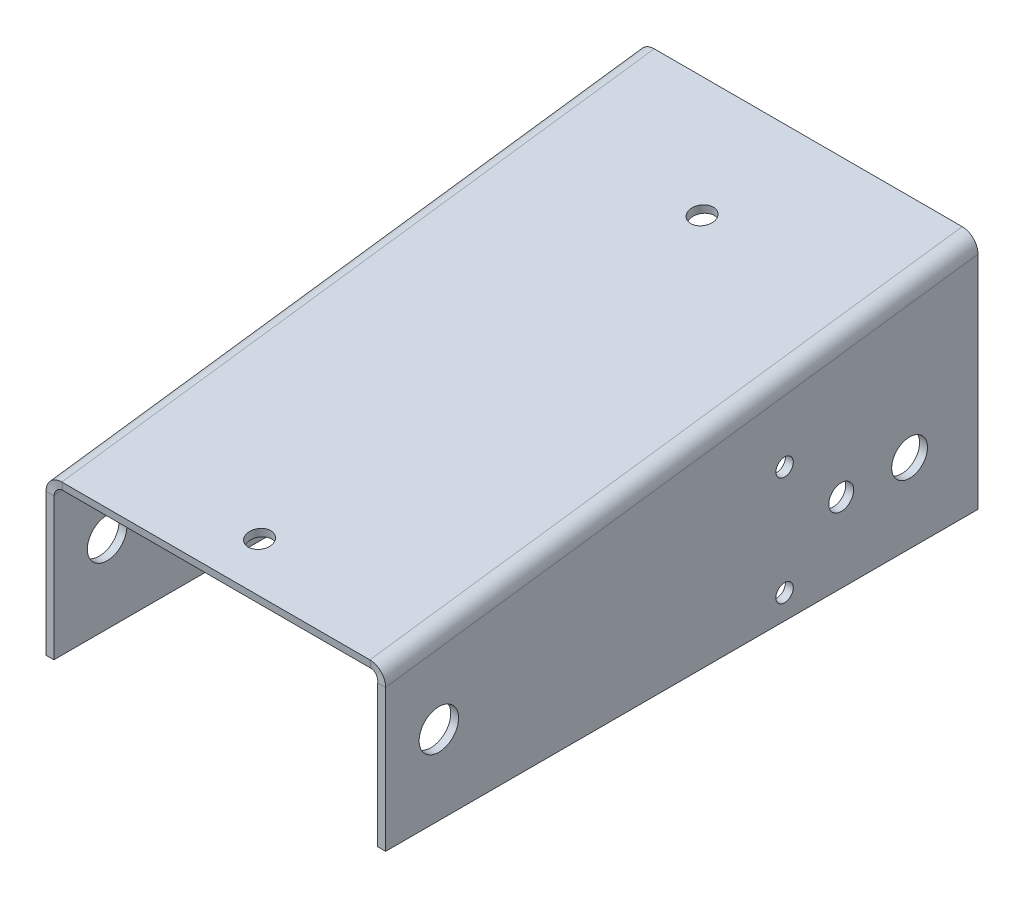
ISO-10303-21;
HEADER;
FILE_DESCRIPTION(('STEP AP214'),'2;1');
FILE_NAME('part.step','',(''),(''),'','','');
FILE_SCHEMA(('AUTOMOTIVE_DESIGN { 1 0 10303 214 1 1 1 1 }'));
ENDSEC;
DATA;
#1=APPLICATION_CONTEXT('core data for automotive mechanical design processes');
#2=APPLICATION_PROTOCOL_DEFINITION('international standard','automotive_design',2000,#1);
#3=PRODUCT_CONTEXT('',#1,'mechanical');
#4=PRODUCT('Part','Part','',(#3));
#5=PRODUCT_RELATED_PRODUCT_CATEGORY('part','',(#4));
#6=PRODUCT_DEFINITION_FORMATION('','',#4);
#7=PRODUCT_DEFINITION_CONTEXT('part definition',#1,'design');
#8=PRODUCT_DEFINITION('design','',#6,#7);
#9=PRODUCT_DEFINITION_SHAPE('','',#8);
#10=(LENGTH_UNIT() NAMED_UNIT(*) SI_UNIT(.MILLI.,.METRE.));
#11=(NAMED_UNIT(*) PLANE_ANGLE_UNIT() SI_UNIT($,.RADIAN.));
#12=(NAMED_UNIT(*) SI_UNIT($,.STERADIAN.) SOLID_ANGLE_UNIT());
#13=UNCERTAINTY_MEASURE_WITH_UNIT(LENGTH_MEASURE(1.E-05),#10,'distance_accuracy_value','');
#14=(GEOMETRIC_REPRESENTATION_CONTEXT(3) GLOBAL_UNCERTAINTY_ASSIGNED_CONTEXT((#13)) GLOBAL_UNIT_ASSIGNED_CONTEXT((#10,
#11,#12)) REPRESENTATION_CONTEXT('',''));
#15=CARTESIAN_POINT('',(0.,0.,0.));
#16=DIRECTION('',(0.,0.,1.));
#17=DIRECTION('',(1.,0.,0.));
#18=AXIS2_PLACEMENT_3D('',#15,#16,#17);
#19=CARTESIAN_POINT('',(54.61,38.1,-95.25));
#20=DIRECTION('',(0.,-0.132163720091018,0.991227900682635));
#21=DIRECTION('',(-1.,0.,0.));
#22=AXIS2_PLACEMENT_3D('',#19,#20,#21);
#23=PLANE('',#22);
#24=DIRECTION('',(0.,0.991227900682635,0.132163720091018));
#25=VECTOR('',#24,1.);
#26=CARTESIAN_POINT('',(52.07,38.1,-95.25));
#27=LINE('',#26,#25);
#28=CARTESIAN_POINT('',(52.07,36.8411405661331,-95.4178479245156));
#29=VERTEX_POINT('',#28);
#30=CARTESIAN_POINT('',(52.07,38.1,-95.25));
#31=VERTEX_POINT('',#30);
#32=EDGE_CURVE('E11',#29,#31,#27,.T.);
#33=ORIENTED_EDGE('',*,*,#32,.F.);
#34=DIRECTION('',(1.,0.,0.));
#35=VECTOR('',#34,1.);
#36=CARTESIAN_POINT('',(54.61,36.8411405661331,-95.4178479245156));
#37=LINE('',#36,#35);
#38=CARTESIAN_POINT('',(2.53999999999997,36.8411405661331,-95.4178479245156));
#39=VERTEX_POINT('',#38);
#40=EDGE_CURVE('E97',#29,#39,#37,.F.);
#41=ORIENTED_EDGE('',*,*,#40,.T.);
#42=DIRECTION('',(0.,0.991227900682635,0.132163720091018));
#43=VECTOR('',#42,1.);
#44=CARTESIAN_POINT('',(2.54,38.1,-95.25));
#45=LINE('',#44,#43);
#46=CARTESIAN_POINT('',(2.54,38.1,-95.25));
#47=VERTEX_POINT('',#46);
#48=EDGE_CURVE('E45',#39,#47,#45,.T.);
#49=ORIENTED_EDGE('',*,*,#48,.T.);
#50=DIRECTION('',(-1.,0.,0.));
#51=VECTOR('',#50,1.);
#52=CARTESIAN_POINT('',(54.61,38.1,-95.25));
#53=LINE('',#52,#51);
#54=EDGE_CURVE('E100',#31,#47,#53,.T.);
#55=ORIENTED_EDGE('',*,*,#54,.F.);
#56=EDGE_LOOP('',(#33,#41,#49,#55));
#57=FACE_BOUND('',#56,.T.);
#58=ADVANCED_FACE('F35',(#57),#23,.F.);
#59=CARTESIAN_POINT('',(2.54,34.2339028053242,-95.0821520754844));
#60=CARTESIAN_POINT('',(2.54,33.8142829940352,-95.1381013836563));
#61=CARTESIAN_POINT('',(2.54,33.3946631827462,-95.1940506918281));
#62=CARTESIAN_POINT('',(2.54,32.9750433714572,-95.25));
#63=CARTESIAN_POINT('',(5.08,34.2339028053242,-95.0821520754844));
#64=CARTESIAN_POINT('',(5.92666666666667,33.8142829940352,-95.1381013836563));
#65=CARTESIAN_POINT('',(6.77333333333334,33.3946631827462,-95.1940506918282));
#66=CARTESIAN_POINT('',(7.62,32.9750433714572,-95.25));
#67=CARTESIAN_POINT('',(5.08,36.841140566133,-95.4178479245156));
#68=CARTESIAN_POINT('',(5.92666666666667,37.2607603774221,-95.3618986163438));
#69=CARTESIAN_POINT('',(6.77333333333334,37.680380188711,-95.3059493081719));
#70=CARTESIAN_POINT('',(7.62,38.1,-95.25));
#71=CARTESIAN_POINT('',(2.54,36.841140566133,-95.4178479245156));
#72=CARTESIAN_POINT('',(2.54,37.260760377422,-95.3618986163437));
#73=CARTESIAN_POINT('',(2.54,37.680380188711,-95.3059493081719));
#74=CARTESIAN_POINT('',(2.54,38.1,-95.25));
#75=CARTESIAN_POINT('',(0.,36.841140566133,-95.4178479245156));
#76=CARTESIAN_POINT('',(-0.846666666666666,37.2607603774221,-95.3618986163438));
#77=CARTESIAN_POINT('',(-1.69333333333333,37.680380188711,-95.3059493081719));
#78=CARTESIAN_POINT('',(-2.54,38.1,-95.25));
#79=CARTESIAN_POINT('',(0.,34.2339028053242,-95.0821520754844));
#80=CARTESIAN_POINT('',(-0.846666666666666,33.8142829940352,-95.1381013836563));
#81=CARTESIAN_POINT('',(-1.69333333333333,33.3946631827462,-95.1940506918282));
#82=CARTESIAN_POINT('',(-2.54,32.9750433714572,-95.25));
#83=CARTESIAN_POINT('',(2.54,34.2339028053242,-95.0821520754844));
#84=CARTESIAN_POINT('',(2.54,33.8142829940352,-95.1381013836563));
#85=CARTESIAN_POINT('',(2.54,33.3946631827462,-95.1940506918281));
#86=CARTESIAN_POINT('',(2.54,32.9750433714572,-95.25));
#87=(BOUNDED_SURFACE() B_SPLINE_SURFACE(3,3,((#59,#60,#61,#62),(#63,#64,#65,#66),(#67,#68,#69,
#70),(#71,#72,#73,#74),(#75,#76,#77,#78),(#79,#80,#81,#82),(#83,#84,#85,#86)),.UNSPECIFIED.,.T.,
.F.,.F.) B_SPLINE_SURFACE_WITH_KNOTS((4,3,4),(4,4),(0.,0.5,1.),(0.,1.),
.UNSPECIFIED.) GEOMETRIC_REPRESENTATION_ITEM() RATIONAL_B_SPLINE_SURFACE(((1.,1.,1.,1.),
(0.333333333333333,0.333333333333333,0.333333333333333,0.333333333333333),(0.333333333333333,
0.333333333333333,0.333333333333333,0.333333333333333),(1.,1.,1.,1.),(0.333333333333333,
0.333333333333333,0.333333333333333,0.333333333333333),(0.333333333333333,0.333333333333333,
0.333333333333333,0.333333333333333),(1.,1.,1.,1.))) REPRESENTATION_ITEM('') SURFACE());
#88=CARTESIAN_POINT('',(2.54,35.5375216857286,-95.25));
#89=DIRECTION('',(0.,0.127701204099617,0.991812685173722));
#90=DIRECTION('',(0.,-0.991812685173722,0.127701204099617));
#91=AXIS2_PLACEMENT_3D('',#88,#89,#90);
#92=ELLIPSE('',#91,1.31438012428335,1.27);
#93=CARTESIAN_POINT('',(1.27,35.5375216857286,-95.25));
#94=VERTEX_POINT('',#93);
#95=EDGE_CURVE('E139',#39,#94,#92,.T.);
#96=DIRECTION('',(-1.,0.,0.));
#97=VECTOR('',#96,1.);
#98=CARTESIAN_POINT('',(0.,35.5375216857286,-95.25));
#99=LINE('',#98,#97);
#100=CARTESIAN_POINT('',(0.,35.5375216857286,-95.25));
#101=VERTEX_POINT('',#100);
#102=EDGE_CURVE('E53',#94,#101,#99,.T.);
#103=CARTESIAN_POINT('',(2.54,35.5375216857286,-95.25));
#104=DIRECTION('',(0.,0.,1.));
#105=DIRECTION('',(0.,-1.,0.));
#106=AXIS2_PLACEMENT_3D('',#103,#104,#105);
#107=ELLIPSE('',#106,2.56247831427138,2.54);
#108=EDGE_CURVE('E208',#47,#101,#107,.T.);
#109=ORIENTED_EDGE('',*,*,#48,.F.);
#110=ORIENTED_EDGE('',*,*,#95,.T.);
#111=ORIENTED_EDGE('',*,*,#102,.T.);
#112=ORIENTED_EDGE('',*,*,#108,.F.);
#113=EDGE_LOOP('',(#109,#110,#111,#112));
#114=FACE_BOUND('',#113,.T.);
#115=ADVANCED_FACE('F209',(#114),#87,.T.);
#116=CARTESIAN_POINT('',(0.,0.,-95.25));
#117=DIRECTION('',(0.,0.,-1.));
#118=DIRECTION('',(0.,1.,0.));
#119=AXIS2_PLACEMENT_3D('',#116,#117,#118);
#120=PLANE('',#119);
#121=ORIENTED_EDGE('',*,*,#102,.F.);
#122=DIRECTION('',(0.,1.,0.));
#123=VECTOR('',#122,1.);
#124=CARTESIAN_POINT('',(1.27,0.,-95.25));
#125=LINE('',#124,#123);
#126=CARTESIAN_POINT('',(1.27,0.,-95.25));
#127=VERTEX_POINT('',#126);
#128=EDGE_CURVE('E254',#127,#94,#125,.T.);
#129=ORIENTED_EDGE('',*,*,#128,.F.);
#130=DIRECTION('',(-1.,0.,0.));
#131=VECTOR('',#130,1.);
#132=CARTESIAN_POINT('',(0.,0.,-95.25));
#133=LINE('',#132,#131);
#134=CARTESIAN_POINT('',(0.,0.,-95.25));
#135=VERTEX_POINT('',#134);
#136=EDGE_CURVE('E192',#127,#135,#133,.T.);
#137=ORIENTED_EDGE('',*,*,#136,.T.);
#138=DIRECTION('',(0.,1.,0.));
#139=VECTOR('',#138,1.);
#140=CARTESIAN_POINT('',(0.,0.,-95.25));
#141=LINE('',#140,#139);
#142=EDGE_CURVE('E271',#135,#101,#141,.T.);
#143=ORIENTED_EDGE('',*,*,#142,.T.);
#144=EDGE_LOOP('',(#121,#129,#137,#143));
#145=FACE_BOUND('',#144,.T.);
#146=ADVANCED_FACE('F269',(#145),#120,.T.);
#147=CARTESIAN_POINT('',(0.,0.,0.));
#148=DIRECTION('',(0.,-1.,0.));
#149=DIRECTION('',(0.,0.,-1.));
#150=AXIS2_PLACEMENT_3D('',#147,#148,#149);
#151=PLANE('',#150);
#152=ORIENTED_EDGE('',*,*,#136,.F.);
#153=DIRECTION('',(0.,0.,-1.));
#154=VECTOR('',#153,1.);
#155=CARTESIAN_POINT('',(1.27,0.,0.));
#156=LINE('',#155,#154);
#157=CARTESIAN_POINT('',(1.27,0.,0.));
#158=VERTEX_POINT('',#157);
#159=EDGE_CURVE('E165',#158,#127,#156,.T.);
#160=ORIENTED_EDGE('',*,*,#159,.F.);
#161=DIRECTION('',(-1.,0.,0.));
#162=VECTOR('',#161,1.);
#163=CARTESIAN_POINT('',(0.,0.,0.));
#164=LINE('',#163,#162);
#165=CARTESIAN_POINT('',(0.,0.,0.));
#166=VERTEX_POINT('',#165);
#167=EDGE_CURVE('E189',#158,#166,#164,.T.);
#168=ORIENTED_EDGE('',*,*,#167,.T.);
#169=DIRECTION('',(0.,0.,-1.));
#170=VECTOR('',#169,1.);
#171=CARTESIAN_POINT('',(0.,0.,0.));
#172=LINE('',#171,#170);
#173=EDGE_CURVE('E275',#166,#135,#172,.T.);
#174=ORIENTED_EDGE('',*,*,#173,.T.);
#175=EDGE_LOOP('',(#152,#160,#168,#174));
#176=FACE_BOUND('',#175,.T.);
#177=ADVANCED_FACE('F493',(#176),#151,.T.);
#178=CARTESIAN_POINT('',(0.,25.4,0.));
#179=DIRECTION('',(0.,0.,1.));
#180=DIRECTION('',(0.,-1.,0.));
#181=AXIS2_PLACEMENT_3D('',#178,#179,#180);
#182=PLANE('',#181);
#183=ORIENTED_EDGE('',*,*,#167,.F.);
#184=DIRECTION('',(0.,1.,0.));
#185=VECTOR('',#184,1.);
#186=CARTESIAN_POINT('',(1.27,0.,0.));
#187=LINE('',#186,#185);
#188=CARTESIAN_POINT('',(1.27,22.8375216857286,0.));
#189=VERTEX_POINT('',#188);
#190=EDGE_CURVE('E160',#189,#158,#187,.F.);
#191=ORIENTED_EDGE('',*,*,#190,.F.);
#192=DIRECTION('',(-1.,0.,0.));
#193=VECTOR('',#192,1.);
#194=CARTESIAN_POINT('',(0.,22.8375216857286,0.));
#195=LINE('',#194,#193);
#196=CARTESIAN_POINT('',(0.,22.8375216857286,0.));
#197=VERTEX_POINT('',#196);
#198=EDGE_CURVE('E187',#189,#197,#195,.T.);
#199=ORIENTED_EDGE('',*,*,#198,.T.);
#200=DIRECTION('',(0.,-1.,0.));
#201=VECTOR('',#200,1.);
#202=CARTESIAN_POINT('',(0.,25.4,0.));
#203=LINE('',#202,#201);
#204=EDGE_CURVE('E276',#197,#166,#203,.T.);
#205=ORIENTED_EDGE('',*,*,#204,.T.);
#206=EDGE_LOOP('',(#183,#191,#199,#205));
#207=FACE_BOUND('',#206,.T.);
#208=ADVANCED_FACE('F494',(#207),#182,.T.);
#209=CARTESIAN_POINT('',(2.54,20.2750433714572,0.));
#210=CARTESIAN_POINT('',(2.54,20.6946631827462,0.0559493081718648));
#211=CARTESIAN_POINT('',(2.54,21.1142829940352,0.11189861634373));
#212=CARTESIAN_POINT('',(2.54,21.5339028053242,0.167847924515595));
#213=CARTESIAN_POINT('',(-2.54,20.2750433714572,0.));
#214=CARTESIAN_POINT('',(-1.69333333333333,20.6946631827462,0.0559493081718648));
#215=CARTESIAN_POINT('',(-0.846666666666666,21.1142829940352,0.11189861634373));
#216=CARTESIAN_POINT('',(0.,21.5339028053242,0.167847924515595));
#217=CARTESIAN_POINT('',(-2.54,25.4,0.));
#218=CARTESIAN_POINT('',(-1.69333333333333,24.980380188711,-0.0559493081718648));
#219=CARTESIAN_POINT('',(-0.846666666666666,24.560760377422,-0.11189861634373));
#220=CARTESIAN_POINT('',(0.,24.141140566133,-0.167847924515595));
#221=CARTESIAN_POINT('',(2.54,25.4,0.));
#222=CARTESIAN_POINT('',(2.54,24.980380188711,-0.0559493081718648));
#223=CARTESIAN_POINT('',(2.54,24.560760377422,-0.11189861634373));
#224=CARTESIAN_POINT('',(2.54,24.141140566133,-0.167847924515595));
#225=CARTESIAN_POINT('',(7.62,25.4,0.));
#226=CARTESIAN_POINT('',(6.77333333333334,24.980380188711,-0.0559493081718648));
#227=CARTESIAN_POINT('',(5.92666666666667,24.560760377422,-0.11189861634373));
#228=CARTESIAN_POINT('',(5.08,24.141140566133,-0.167847924515595));
#229=CARTESIAN_POINT('',(7.62,20.2750433714572,0.));
#230=CARTESIAN_POINT('',(6.77333333333334,20.6946631827462,0.0559493081718648));
#231=CARTESIAN_POINT('',(5.92666666666667,21.1142829940352,0.11189861634373));
#232=CARTESIAN_POINT('',(5.08,21.5339028053242,0.167847924515595));
#233=CARTESIAN_POINT('',(2.54,20.2750433714572,0.));
#234=CARTESIAN_POINT('',(2.54,20.6946631827462,0.0559493081718648));
#235=CARTESIAN_POINT('',(2.54,21.1142829940352,0.11189861634373));
#236=CARTESIAN_POINT('',(2.54,21.5339028053242,0.167847924515595));
#237=(BOUNDED_SURFACE() B_SPLINE_SURFACE(3,3,((#209,#210,#211,#212),(#213,#214,#215,#216),(#217,
#218,#219,#220),(#221,#222,#223,#224),(#225,#226,#227,#228),(#229,#230,#231,#232),(#233,#234,
#235,#236)),.UNSPECIFIED.,.T.,.F.,.F.) B_SPLINE_SURFACE_WITH_KNOTS((4,3,4),(4,4),(0.,0.5,1.),
(0.,1.),.UNSPECIFIED.) GEOMETRIC_REPRESENTATION_ITEM() RATIONAL_B_SPLINE_SURFACE(((1.,1.,1.,1.),
(0.333333333333333,0.333333333333333,0.333333333333333,0.333333333333333),(0.333333333333333,
0.333333333333333,0.333333333333333,0.333333333333333),(1.,1.,1.,1.),(0.333333333333333,
0.333333333333333,0.333333333333333,0.333333333333333),(0.333333333333333,0.333333333333333,
0.333333333333333,0.333333333333333),(1.,1.,1.,1.))) REPRESENTATION_ITEM('') SURFACE());
#238=CARTESIAN_POINT('',(2.54,22.8375216857286,0.));
#239=DIRECTION('',(0.,0.127701204099622,0.991812685173721));
#240=DIRECTION('',(0.,-0.991812685173721,0.127701204099622));
#241=AXIS2_PLACEMENT_3D('',#238,#239,#240);
#242=ELLIPSE('',#241,1.31438012428335,1.27);
#243=CARTESIAN_POINT('',(2.54,24.141140566133,-0.167847924515583));
#244=VERTEX_POINT('',#243);
#245=EDGE_CURVE('E249',#189,#244,#242,.F.);
#246=DIRECTION('',(0.,0.991227900682635,0.132163720091018));
#247=VECTOR('',#246,1.);
#248=CARTESIAN_POINT('',(2.54,25.4,0.));
#249=LINE('',#248,#247);
#250=CARTESIAN_POINT('',(2.54,25.4,0.));
#251=VERTEX_POINT('',#250);
#252=EDGE_CURVE('E184',#244,#251,#249,.T.);
#253=CARTESIAN_POINT('',(2.54,22.8375216857286,0.));
#254=DIRECTION('',(0.,0.,1.));
#255=DIRECTION('',(0.,-1.,0.));
#256=AXIS2_PLACEMENT_3D('',#253,#254,#255);
#257=ELLIPSE('',#256,2.56247831427138,2.54);
#258=EDGE_CURVE('E214',#197,#251,#257,.F.);
#259=ORIENTED_EDGE('',*,*,#198,.F.);
#260=ORIENTED_EDGE('',*,*,#245,.T.);
#261=ORIENTED_EDGE('',*,*,#252,.T.);
#262=ORIENTED_EDGE('',*,*,#258,.F.);
#263=EDGE_LOOP('',(#259,#260,#261,#262));
#264=FACE_BOUND('',#263,.T.);
#265=ADVANCED_FACE('F287',(#264),#237,.F.);
#266=CARTESIAN_POINT('',(54.61,25.4,0.));
#267=DIRECTION('',(0.,-0.132163720091018,0.991227900682635));
#268=DIRECTION('',(-1.,0.,0.));
#269=AXIS2_PLACEMENT_3D('',#266,#267,#268);
#270=PLANE('',#269);
#271=ORIENTED_EDGE('',*,*,#252,.F.);
#272=DIRECTION('',(1.,0.,0.));
#273=VECTOR('',#272,1.);
#274=CARTESIAN_POINT('',(54.61,24.141140566133,-0.16784792451556));
#275=LINE('',#274,#273);
#276=CARTESIAN_POINT('',(52.07,24.141140566133,-0.16784792451556));
#277=VERTEX_POINT('',#276);
#278=EDGE_CURVE('E128',#277,#244,#275,.F.);
#279=ORIENTED_EDGE('',*,*,#278,.F.);
#280=DIRECTION('',(0.,0.991227900682635,0.132163720091018));
#281=VECTOR('',#280,1.);
#282=CARTESIAN_POINT('',(52.07,25.4,0.));
#283=LINE('',#282,#281);
#284=CARTESIAN_POINT('',(52.07,25.4,0.));
#285=VERTEX_POINT('',#284);
#286=EDGE_CURVE('E181',#277,#285,#283,.T.);
#287=ORIENTED_EDGE('',*,*,#286,.T.);
#288=DIRECTION('',(-1.,0.,0.));
#289=VECTOR('',#288,1.);
#290=CARTESIAN_POINT('',(54.61,25.4,0.));
#291=LINE('',#290,#289);
#292=EDGE_CURVE('E206',#285,#251,#291,.T.);
#293=ORIENTED_EDGE('',*,*,#292,.T.);
#294=EDGE_LOOP('',(#271,#279,#287,#293));
#295=FACE_BOUND('',#294,.T.);
#296=ADVANCED_FACE('F290',(#295),#270,.T.);
#297=CARTESIAN_POINT('',(52.07,24.1411405661331,-0.167847924515591));
#298=CARTESIAN_POINT('',(52.07,24.560760377422,-0.111898616343727));
#299=CARTESIAN_POINT('',(52.07,24.980380188711,-0.0559493081718624));
#300=CARTESIAN_POINT('',(52.07,25.4,0.));
#301=CARTESIAN_POINT('',(54.61,24.1411405661331,-0.167847924515591));
#302=CARTESIAN_POINT('',(55.4566666666667,24.560760377422,-0.111898616343727));
#303=CARTESIAN_POINT('',(56.3033333333334,24.980380188711,-0.0559493081718624));
#304=CARTESIAN_POINT('',(57.15,25.4,0.));
#305=CARTESIAN_POINT('',(54.61,21.5339028053242,0.167847924515594));
#306=CARTESIAN_POINT('',(55.4566666666667,21.1142829940352,0.11189861634373));
#307=CARTESIAN_POINT('',(56.3033333333334,20.6946631827462,0.0559493081718659));
#308=CARTESIAN_POINT('',(57.15,20.2750433714572,0.));
#309=CARTESIAN_POINT('',(52.07,21.5339028053242,0.167847924515595));
#310=CARTESIAN_POINT('',(52.07,21.1142829940352,0.11189861634373));
#311=CARTESIAN_POINT('',(52.07,20.6946631827462,0.0559493081718659));
#312=CARTESIAN_POINT('',(52.07,20.2750433714572,0.));
#313=CARTESIAN_POINT('',(49.53,21.5339028053242,0.167847924515595));
#314=CARTESIAN_POINT('',(48.6833333333334,21.1142829940352,0.11189861634373));
#315=CARTESIAN_POINT('',(47.8366666666667,20.6946631827462,0.0559493081718659));
#316=CARTESIAN_POINT('',(46.99,20.2750433714572,0.));
#317=CARTESIAN_POINT('',(49.53,24.1411405661331,-0.167847924515591));
#318=CARTESIAN_POINT('',(48.6833333333334,24.560760377422,-0.111898616343727));
#319=CARTESIAN_POINT('',(47.8366666666667,24.980380188711,-0.0559493081718624));
#320=CARTESIAN_POINT('',(46.99,25.4,0.));
#321=CARTESIAN_POINT('',(52.07,24.1411405661331,-0.167847924515591));
#322=CARTESIAN_POINT('',(52.07,24.560760377422,-0.111898616343727));
#323=CARTESIAN_POINT('',(52.07,24.980380188711,-0.0559493081718624));
#324=CARTESIAN_POINT('',(52.07,25.4,0.));
#325=(BOUNDED_SURFACE() B_SPLINE_SURFACE(3,3,((#297,#298,#299,#300),(#301,#302,#303,#304),(#305,
#306,#307,#308),(#309,#310,#311,#312),(#313,#314,#315,#316),(#317,#318,#319,#320),(#321,#322,
#323,#324)),.UNSPECIFIED.,.T.,.F.,.F.) B_SPLINE_SURFACE_WITH_KNOTS((4,3,4),(4,4),(0.,0.5,1.),
(0.,1.),.UNSPECIFIED.) GEOMETRIC_REPRESENTATION_ITEM() RATIONAL_B_SPLINE_SURFACE(((1.,1.,1.,1.),
(0.333333333333333,0.333333333333333,0.333333333333333,0.333333333333333),(0.333333333333333,
0.333333333333333,0.333333333333333,0.333333333333333),(1.,1.,1.,1.),(0.333333333333333,
0.333333333333333,0.333333333333333,0.333333333333333),(0.333333333333333,0.333333333333333,
0.333333333333333,0.333333333333333),(1.,1.,1.,1.))) REPRESENTATION_ITEM('') SURFACE());
#326=CARTESIAN_POINT('',(52.07,22.8375216857286,0.));
#327=DIRECTION('',(0.,-0.127701204099621,-0.991812685173721));
#328=DIRECTION('',(0.,0.991812685173721,-0.127701204099621));
#329=AXIS2_PLACEMENT_3D('',#326,#327,#328);
#330=ELLIPSE('',#329,1.31438012428335,1.27);
#331=CARTESIAN_POINT('',(53.34,22.8375216857286,0.));
#332=VERTEX_POINT('',#331);
#333=EDGE_CURVE('E116',#277,#332,#330,.T.);
#334=DIRECTION('',(1.,0.,0.));
#335=VECTOR('',#334,1.);
#336=CARTESIAN_POINT('',(54.61,22.8375216857286,0.));
#337=LINE('',#336,#335);
#338=CARTESIAN_POINT('',(54.61,22.8375216857286,0.));
#339=VERTEX_POINT('',#338);
#340=EDGE_CURVE('E178',#332,#339,#337,.T.);
#341=CARTESIAN_POINT('',(52.07,22.8375216857286,0.));
#342=DIRECTION('',(0.,0.,-1.));
#343=DIRECTION('',(0.,1.,0.));
#344=AXIS2_PLACEMENT_3D('',#341,#342,#343);
#345=ELLIPSE('',#344,2.56247831427138,2.54);
#346=EDGE_CURVE('E213',#285,#339,#345,.T.);
#347=ORIENTED_EDGE('',*,*,#286,.F.);
#348=ORIENTED_EDGE('',*,*,#333,.T.);
#349=ORIENTED_EDGE('',*,*,#340,.T.);
#350=ORIENTED_EDGE('',*,*,#346,.F.);
#351=EDGE_LOOP('',(#347,#348,#349,#350));
#352=FACE_BOUND('',#351,.T.);
#353=ADVANCED_FACE('F537',(#352),#325,.T.);
#354=CARTESIAN_POINT('',(54.61,25.4,0.));
#355=DIRECTION('',(0.,0.,1.));
#356=DIRECTION('',(0.,-1.,0.));
#357=AXIS2_PLACEMENT_3D('',#354,#355,#356);
#358=PLANE('',#357);
#359=ORIENTED_EDGE('',*,*,#340,.F.);
#360=DIRECTION('',(0.,1.,0.));
#361=VECTOR('',#360,1.);
#362=CARTESIAN_POINT('',(53.34,0.,0.));
#363=LINE('',#362,#361);
#364=CARTESIAN_POINT('',(53.34,0.,0.));
#365=VERTEX_POINT('',#364);
#366=EDGE_CURVE('E241',#332,#365,#363,.F.);
#367=ORIENTED_EDGE('',*,*,#366,.T.);
#368=DIRECTION('',(1.,0.,0.));
#369=VECTOR('',#368,1.);
#370=CARTESIAN_POINT('',(54.61,0.,0.));
#371=LINE('',#370,#369);
#372=CARTESIAN_POINT('',(54.61,0.,0.));
#373=VERTEX_POINT('',#372);
#374=EDGE_CURVE('E175',#365,#373,#371,.T.);
#375=ORIENTED_EDGE('',*,*,#374,.T.);
#376=DIRECTION('',(0.,-1.,0.));
#377=VECTOR('',#376,1.);
#378=CARTESIAN_POINT('',(54.61,25.4,0.));
#379=LINE('',#378,#377);
#380=EDGE_CURVE('E320',#339,#373,#379,.T.);
#381=ORIENTED_EDGE('',*,*,#380,.F.);
#382=EDGE_LOOP('',(#359,#367,#375,#381));
#383=FACE_BOUND('',#382,.T.);
#384=ADVANCED_FACE('F481',(#383),#358,.T.);
#385=CARTESIAN_POINT('',(54.61,0.,0.));
#386=DIRECTION('',(0.,-1.,0.));
#387=DIRECTION('',(0.,0.,-1.));
#388=AXIS2_PLACEMENT_3D('',#385,#386,#387);
#389=PLANE('',#388);
#390=ORIENTED_EDGE('',*,*,#374,.F.);
#391=DIRECTION('',(0.,0.,-1.));
#392=VECTOR('',#391,1.);
#393=CARTESIAN_POINT('',(53.34,0.,0.));
#394=LINE('',#393,#392);
#395=CARTESIAN_POINT('',(53.34,0.,-95.25));
#396=VERTEX_POINT('',#395);
#397=EDGE_CURVE('E243',#365,#396,#394,.T.);
#398=ORIENTED_EDGE('',*,*,#397,.T.);
#399=DIRECTION('',(1.,0.,0.));
#400=VECTOR('',#399,1.);
#401=CARTESIAN_POINT('',(54.61,0.,-95.25));
#402=LINE('',#401,#400);
#403=CARTESIAN_POINT('',(54.61,0.,-95.25));
#404=VERTEX_POINT('',#403);
#405=EDGE_CURVE('E172',#396,#404,#402,.T.);
#406=ORIENTED_EDGE('',*,*,#405,.T.);
#407=DIRECTION('',(0.,0.,-1.));
#408=VECTOR('',#407,1.);
#409=CARTESIAN_POINT('',(54.61,0.,0.));
#410=LINE('',#409,#408);
#411=EDGE_CURVE('E323',#373,#404,#410,.T.);
#412=ORIENTED_EDGE('',*,*,#411,.F.);
#413=EDGE_LOOP('',(#390,#398,#406,#412));
#414=FACE_BOUND('',#413,.T.);
#415=ADVANCED_FACE('F478',(#414),#389,.T.);
#416=CARTESIAN_POINT('',(54.61,0.,-95.25));
#417=DIRECTION('',(0.,0.,-1.));
#418=DIRECTION('',(0.,1.,0.));
#419=AXIS2_PLACEMENT_3D('',#416,#417,#418);
#420=PLANE('',#419);
#421=ORIENTED_EDGE('',*,*,#405,.F.);
#422=DIRECTION('',(0.,1.,0.));
#423=VECTOR('',#422,1.);
#424=CARTESIAN_POINT('',(53.34,0.,-95.25));
#425=LINE('',#424,#423);
#426=CARTESIAN_POINT('',(53.34,35.5375216857286,-95.25));
#427=VERTEX_POINT('',#426);
#428=EDGE_CURVE('E147',#396,#427,#425,.T.);
#429=ORIENTED_EDGE('',*,*,#428,.T.);
#430=DIRECTION('',(1.,0.,0.));
#431=VECTOR('',#430,1.);
#432=CARTESIAN_POINT('',(54.61,35.5375216857286,-95.25));
#433=LINE('',#432,#431);
#434=CARTESIAN_POINT('',(54.61,35.5375216857286,-95.25));
#435=VERTEX_POINT('',#434);
#436=EDGE_CURVE('E39',#427,#435,#433,.T.);
#437=ORIENTED_EDGE('',*,*,#436,.T.);
#438=DIRECTION('',(0.,1.,0.));
#439=VECTOR('',#438,1.);
#440=CARTESIAN_POINT('',(54.61,0.,-95.25));
#441=LINE('',#440,#439);
#442=EDGE_CURVE('E326',#404,#435,#441,.T.);
#443=ORIENTED_EDGE('',*,*,#442,.F.);
#444=EDGE_LOOP('',(#421,#429,#437,#443));
#445=FACE_BOUND('',#444,.T.);
#446=ADVANCED_FACE('F408',(#445),#420,.T.);
#447=CARTESIAN_POINT('',(27.305,26.3377345048807,-7.03300878660484));
#448=DIRECTION('',(0.,0.991227900682635,0.132163720091018));
#449=DIRECTION('',(0.,-0.132163720091018,0.991227900682635));
#450=AXIS2_PLACEMENT_3D('',#447,#448,#449);
#451=CYLINDRICAL_SURFACE('',#450,1.8288);
#452=CARTESIAN_POINT('',(27.305,26.3377345048807,-7.03300878660484));
#453=DIRECTION('',(0.,0.991227900682635,0.132163720091018));
#454=DIRECTION('',(0.,-0.132163720091018,0.991227900682635));
#455=AXIS2_PLACEMENT_3D('',#452,#453,#454);
#456=CIRCLE('',#455,1.8288);
#457=CARTESIAN_POINT('',(27.305,26.0960334935782,-5.22025120183644));
#458=VERTEX_POINT('',#457);
#459=EDGE_CURVE('E296',#458,#458,#456,.T.);
#460=ORIENTED_EDGE('',*,*,#459,.T.);
#461=EDGE_LOOP('',(#460));
#462=FACE_BOUND('',#461,.T.);
#463=CARTESIAN_POINT('',(27.305,25.0788750710137,-7.20085671112043));
#464=DIRECTION('',(0.,0.991227900682635,0.132163720091018));
#465=DIRECTION('',(0.,-0.132163720091018,0.991227900682635));
#466=AXIS2_PLACEMENT_3D('',#463,#464,#465);
#467=CIRCLE('',#466,1.8288);
#468=CARTESIAN_POINT('',(27.305,24.8371740597113,-5.38809912635203));
#469=VERTEX_POINT('',#468);
#470=EDGE_CURVE('E134',#469,#469,#467,.T.);
#471=ORIENTED_EDGE('',*,*,#470,.F.);
#472=EDGE_LOOP('',(#471));
#473=FACE_BOUND('',#472,.T.);
#474=ADVANCED_FACE('F347',(#462,#473),#451,.F.);
#475=CARTESIAN_POINT('',(27.305,35.8243265522007,-78.1824491415055));
#476=DIRECTION('',(0.,0.991227900682635,0.132163720091018));
#477=DIRECTION('',(0.,-0.132163720091018,0.991227900682635));
#478=AXIS2_PLACEMENT_3D('',#475,#476,#477);
#479=CYLINDRICAL_SURFACE('',#478,1.82879999999999);
#480=CARTESIAN_POINT('',(27.305,35.8243265522007,-78.1824491415055));
#481=DIRECTION('',(0.,0.991227900682635,0.132163720091018));
#482=DIRECTION('',(0.,-0.132163720091018,0.991227900682635));
#483=AXIS2_PLACEMENT_3D('',#480,#481,#482);
#484=CIRCLE('',#483,1.82879999999999);
#485=CARTESIAN_POINT('',(27.305,35.5826255408983,-76.3696915567371));
#486=VERTEX_POINT('',#485);
#487=EDGE_CURVE('E293',#486,#486,#484,.T.);
#488=ORIENTED_EDGE('',*,*,#487,.T.);
#489=EDGE_LOOP('',(#488));
#490=FACE_BOUND('',#489,.T.);
#491=CARTESIAN_POINT('',(27.305,34.5654671183338,-78.3502970660211));
#492=DIRECTION('',(0.,0.991227900682635,0.132163720091018));
#493=DIRECTION('',(0.,-0.132163720091018,0.991227900682635));
#494=AXIS2_PLACEMENT_3D('',#491,#492,#493);
#495=CIRCLE('',#494,1.82879999999999);
#496=CARTESIAN_POINT('',(27.305,34.3237661070313,-76.5375394812527));
#497=VERTEX_POINT('',#496);
#498=EDGE_CURVE('E137',#497,#497,#495,.T.);
#499=ORIENTED_EDGE('',*,*,#498,.F.);
#500=EDGE_LOOP('',(#499));
#501=FACE_BOUND('',#500,.T.);
#502=ADVANCED_FACE('F356',(#490,#501),#479,.F.);
#503=CARTESIAN_POINT('',(0.,3.95000002599999,-64.15));
#504=DIRECTION('',(1.,0.,0.));
#505=DIRECTION('',(0.,0.,-1.));
#506=AXIS2_PLACEMENT_3D('',#503,#504,#505);
#507=CYLINDRICAL_SURFACE('',#506,1.4);
#508=CARTESIAN_POINT('',(0.,3.95000002599999,-64.15));
#509=DIRECTION('',(1.,0.,0.));
#510=DIRECTION('',(0.,0.,-1.));
#511=AXIS2_PLACEMENT_3D('',#508,#509,#510);
#512=CIRCLE('',#511,1.4);
#513=CARTESIAN_POINT('',(0.,3.95000002599999,-65.55));
#514=VERTEX_POINT('',#513);
#515=EDGE_CURVE('E205',#514,#514,#512,.T.);
#516=ORIENTED_EDGE('',*,*,#515,.F.);
#517=EDGE_LOOP('',(#516));
#518=FACE_BOUND('',#517,.T.);
#519=CARTESIAN_POINT('',(1.27,3.95000002599999,-64.15));
#520=DIRECTION('',(1.,0.,0.));
#521=DIRECTION('',(0.,0.,-1.));
#522=AXIS2_PLACEMENT_3D('',#519,#520,#521);
#523=CIRCLE('',#522,1.4);
#524=CARTESIAN_POINT('',(1.27,3.95000002599999,-65.55));
#525=VERTEX_POINT('',#524);
#526=EDGE_CURVE('E127',#525,#525,#523,.T.);
#527=ORIENTED_EDGE('',*,*,#526,.T.);
#528=EDGE_LOOP('',(#527));
#529=FACE_BOUND('',#528,.T.);
#530=ADVANCED_FACE('F359',(#518,#529),#507,.F.);
#531=CARTESIAN_POINT('',(0.,12.7,-73.25));
#532=DIRECTION('',(1.,0.,0.));
#533=DIRECTION('',(0.,0.,-1.));
#534=AXIS2_PLACEMENT_3D('',#531,#532,#533);
#535=CYLINDRICAL_SURFACE('',#534,2.);
#536=CARTESIAN_POINT('',(0.,12.7,-73.25));
#537=DIRECTION('',(1.,0.,0.));
#538=DIRECTION('',(0.,0.,-1.));
#539=AXIS2_PLACEMENT_3D('',#536,#537,#538);
#540=CIRCLE('',#539,2.);
#541=CARTESIAN_POINT('',(0.,12.7,-75.25));
#542=VERTEX_POINT('',#541);
#543=EDGE_CURVE('E284',#542,#542,#540,.T.);
#544=ORIENTED_EDGE('',*,*,#543,.F.);
#545=EDGE_LOOP('',(#544));
#546=FACE_BOUND('',#545,.T.);
#547=CARTESIAN_POINT('',(1.27,12.7,-73.25));
#548=DIRECTION('',(1.,0.,0.));
#549=DIRECTION('',(0.,0.,-1.));
#550=AXIS2_PLACEMENT_3D('',#547,#548,#549);
#551=CIRCLE('',#550,2.);
#552=CARTESIAN_POINT('',(1.27,12.7,-75.25));
#553=VERTEX_POINT('',#552);
#554=EDGE_CURVE('E157',#553,#553,#551,.T.);
#555=ORIENTED_EDGE('',*,*,#554,.T.);
#556=EDGE_LOOP('',(#555));
#557=FACE_BOUND('',#556,.T.);
#558=ADVANCED_FACE('F412',(#546,#557),#535,.F.);
#559=CARTESIAN_POINT('',(0.,12.7,-84.25));
#560=DIRECTION('',(1.,0.,0.));
#561=DIRECTION('',(0.,0.,-1.));
#562=AXIS2_PLACEMENT_3D('',#559,#560,#561);
#563=CYLINDRICAL_SURFACE('',#562,2.87699996099999);
#564=CARTESIAN_POINT('',(0.,12.7,-84.25));
#565=DIRECTION('',(1.,0.,0.));
#566=DIRECTION('',(0.,0.,-1.));
#567=AXIS2_PLACEMENT_3D('',#564,#565,#566);
#568=CIRCLE('',#567,2.87699996099999);
#569=CARTESIAN_POINT('',(0.,12.7,-87.126999961));
#570=VERTEX_POINT('',#569);
#571=EDGE_CURVE('E305',#570,#570,#568,.T.);
#572=ORIENTED_EDGE('',*,*,#571,.F.);
#573=EDGE_LOOP('',(#572));
#574=FACE_BOUND('',#573,.T.);
#575=CARTESIAN_POINT('',(1.27,12.7,-84.25));
#576=DIRECTION('',(1.,0.,0.));
#577=DIRECTION('',(0.,0.,-1.));
#578=AXIS2_PLACEMENT_3D('',#575,#576,#577);
#579=CIRCLE('',#578,2.87699996099999);
#580=CARTESIAN_POINT('',(1.27,12.7,-87.126999961));
#581=VERTEX_POINT('',#580);
#582=EDGE_CURVE('E161',#581,#581,#579,.T.);
#583=ORIENTED_EDGE('',*,*,#582,.T.);
#584=EDGE_LOOP('',(#583));
#585=FACE_BOUND('',#584,.T.);
#586=ADVANCED_FACE('F416',(#574,#585),#563,.F.);
#587=CARTESIAN_POINT('',(0.,21.450000026,-64.15));
#588=DIRECTION('',(1.,0.,0.));
#589=DIRECTION('',(0.,0.,-1.));
#590=AXIS2_PLACEMENT_3D('',#587,#588,#589);
#591=CYLINDRICAL_SURFACE('',#590,1.4);
#592=CARTESIAN_POINT('',(0.,21.450000026,-64.15));
#593=DIRECTION('',(1.,0.,0.));
#594=DIRECTION('',(0.,0.,-1.));
#595=AXIS2_PLACEMENT_3D('',#592,#593,#594);
#596=CIRCLE('',#595,1.4);
#597=CARTESIAN_POINT('',(0.,21.450000026,-65.55));
#598=VERTEX_POINT('',#597);
#599=EDGE_CURVE('E308',#598,#598,#596,.T.);
#600=ORIENTED_EDGE('',*,*,#599,.F.);
#601=EDGE_LOOP('',(#600));
#602=FACE_BOUND('',#601,.T.);
#603=CARTESIAN_POINT('',(1.27,21.450000026,-64.15));
#604=DIRECTION('',(1.,0.,0.));
#605=DIRECTION('',(0.,0.,-1.));
#606=AXIS2_PLACEMENT_3D('',#603,#604,#605);
#607=CIRCLE('',#606,1.4);
#608=CARTESIAN_POINT('',(1.27,21.450000026,-65.55));
#609=VERTEX_POINT('',#608);
#610=EDGE_CURVE('E164',#609,#609,#607,.T.);
#611=ORIENTED_EDGE('',*,*,#610,.T.);
#612=EDGE_LOOP('',(#611));
#613=FACE_BOUND('',#612,.T.);
#614=ADVANCED_FACE('F419',(#602,#613),#591,.F.);
#615=CARTESIAN_POINT('',(0.,12.7,-8.55800000000001));
#616=DIRECTION('',(1.,0.,0.));
#617=DIRECTION('',(0.,0.,-1.));
#618=AXIS2_PLACEMENT_3D('',#615,#616,#617);
#619=CYLINDRICAL_SURFACE('',#618,3.175);
#620=CARTESIAN_POINT('',(0.,12.7,-8.55800000000001));
#621=DIRECTION('',(1.,0.,0.));
#622=DIRECTION('',(0.,0.,-1.));
#623=AXIS2_PLACEMENT_3D('',#620,#621,#622);
#624=CIRCLE('',#623,3.175);
#625=CARTESIAN_POINT('',(0.,12.7,-11.733));
#626=VERTEX_POINT('',#625);
#627=EDGE_CURVE('E311',#626,#626,#624,.T.);
#628=ORIENTED_EDGE('',*,*,#627,.F.);
#629=EDGE_LOOP('',(#628));
#630=FACE_BOUND('',#629,.T.);
#631=CARTESIAN_POINT('',(1.27,12.7,-8.55800000000001));
#632=DIRECTION('',(1.,0.,0.));
#633=DIRECTION('',(0.,0.,-1.));
#634=AXIS2_PLACEMENT_3D('',#631,#632,#633);
#635=CIRCLE('',#634,3.175);
#636=CARTESIAN_POINT('',(1.27,12.7,-11.733));
#637=VERTEX_POINT('',#636);
#638=EDGE_CURVE('E168',#637,#637,#635,.T.);
#639=ORIENTED_EDGE('',*,*,#638,.T.);
#640=EDGE_LOOP('',(#639));
#641=FACE_BOUND('',#640,.T.);
#642=ADVANCED_FACE('F37',(#630,#641),#619,.F.);
#643=CARTESIAN_POINT('',(54.61,3.95000002599999,-64.15));
#644=DIRECTION('',(1.,0.,0.));
#645=DIRECTION('',(0.,0.,-1.));
#646=AXIS2_PLACEMENT_3D('',#643,#644,#645);
#647=CYLINDRICAL_SURFACE('',#646,1.4);
#648=CARTESIAN_POINT('',(54.61,3.95000002599999,-64.15));
#649=DIRECTION('',(1.,0.,0.));
#650=DIRECTION('',(0.,0.,-1.));
#651=AXIS2_PLACEMENT_3D('',#648,#649,#650);
#652=CIRCLE('',#651,1.4);
#653=CARTESIAN_POINT('',(54.61,3.95000002599999,-65.55));
#654=VERTEX_POINT('',#653);
#655=EDGE_CURVE('E314',#654,#654,#652,.T.);
#656=ORIENTED_EDGE('',*,*,#655,.T.);
#657=EDGE_LOOP('',(#656));
#658=FACE_BOUND('',#657,.T.);
#659=CARTESIAN_POINT('',(53.34,3.95000002599999,-64.15));
#660=DIRECTION('',(1.,0.,0.));
#661=DIRECTION('',(0.,0.,-1.));
#662=AXIS2_PLACEMENT_3D('',#659,#660,#661);
#663=CIRCLE('',#662,1.4);
#664=CARTESIAN_POINT('',(53.34,3.95000002599999,-65.55));
#665=VERTEX_POINT('',#664);
#666=EDGE_CURVE('E171',#665,#665,#663,.T.);
#667=ORIENTED_EDGE('',*,*,#666,.F.);
#668=EDGE_LOOP('',(#667));
#669=FACE_BOUND('',#668,.T.);
#670=ADVANCED_FACE('F426',(#658,#669),#647,.F.);
#671=CARTESIAN_POINT('',(54.61,12.7,-73.25));
#672=DIRECTION('',(1.,0.,0.));
#673=DIRECTION('',(0.,0.,-1.));
#674=AXIS2_PLACEMENT_3D('',#671,#672,#673);
#675=CYLINDRICAL_SURFACE('',#674,2.);
#676=CARTESIAN_POINT('',(54.61,12.7,-73.25));
#677=DIRECTION('',(1.,0.,0.));
#678=DIRECTION('',(0.,0.,-1.));
#679=AXIS2_PLACEMENT_3D('',#676,#677,#678);
#680=CIRCLE('',#679,2.);
#681=CARTESIAN_POINT('',(54.61,12.7,-75.25));
#682=VERTEX_POINT('',#681);
#683=EDGE_CURVE('E317',#682,#682,#680,.T.);
#684=ORIENTED_EDGE('',*,*,#683,.T.);
#685=EDGE_LOOP('',(#684));
#686=FACE_BOUND('',#685,.T.);
#687=CARTESIAN_POINT('',(53.34,12.7,-73.25));
#688=DIRECTION('',(1.,0.,0.));
#689=DIRECTION('',(0.,0.,-1.));
#690=AXIS2_PLACEMENT_3D('',#687,#688,#689);
#691=CIRCLE('',#690,2.);
#692=CARTESIAN_POINT('',(53.34,12.7,-75.25));
#693=VERTEX_POINT('',#692);
#694=EDGE_CURVE('E238',#693,#693,#691,.T.);
#695=ORIENTED_EDGE('',*,*,#694,.F.);
#696=EDGE_LOOP('',(#695));
#697=FACE_BOUND('',#696,.T.);
#698=ADVANCED_FACE('F389',(#686,#697),#675,.F.);
#699=CARTESIAN_POINT('',(52.07,38.1,-95.25));
#700=CARTESIAN_POINT('',(52.07,37.680380188711,-95.3059493081719));
#701=CARTESIAN_POINT('',(52.07,37.260760377422,-95.3618986163437));
#702=CARTESIAN_POINT('',(52.07,36.8411405661331,-95.4178479245156));
#703=CARTESIAN_POINT('',(46.99,38.1,-95.25));
#704=CARTESIAN_POINT('',(47.8366666666667,37.680380188711,-95.3059493081719));
#705=CARTESIAN_POINT('',(48.6833333333334,37.2607603774221,-95.3618986163438));
#706=CARTESIAN_POINT('',(49.53,36.8411405661331,-95.4178479245156));
#707=CARTESIAN_POINT('',(46.99,32.9750433714572,-95.25));
#708=CARTESIAN_POINT('',(47.8366666666667,33.3946631827462,-95.1940506918282));
#709=CARTESIAN_POINT('',(48.6833333333334,33.8142829940352,-95.1381013836563));
#710=CARTESIAN_POINT('',(49.53,34.2339028053242,-95.0821520754844));
#711=CARTESIAN_POINT('',(52.07,32.9750433714572,-95.25));
#712=CARTESIAN_POINT('',(52.07,33.3946631827462,-95.1940506918281));
#713=CARTESIAN_POINT('',(52.07,33.8142829940352,-95.1381013836562));
#714=CARTESIAN_POINT('',(52.07,34.2339028053242,-95.0821520754844));
#715=CARTESIAN_POINT('',(57.15,32.9750433714572,-95.25));
#716=CARTESIAN_POINT('',(56.3033333333333,33.3946631827462,-95.1940506918282));
#717=CARTESIAN_POINT('',(55.4566666666667,33.8142829940352,-95.1381013836563));
#718=CARTESIAN_POINT('',(54.61,34.2339028053242,-95.0821520754844));
#719=CARTESIAN_POINT('',(57.15,38.1,-95.25));
#720=CARTESIAN_POINT('',(56.3033333333333,37.680380188711,-95.3059493081719));
#721=CARTESIAN_POINT('',(55.4566666666667,37.2607603774221,-95.3618986163438));
#722=CARTESIAN_POINT('',(54.61,36.8411405661331,-95.4178479245156));
#723=CARTESIAN_POINT('',(52.07,38.1,-95.25));
#724=CARTESIAN_POINT('',(52.07,37.680380188711,-95.3059493081719));
#725=CARTESIAN_POINT('',(52.07,37.260760377422,-95.3618986163437));
#726=CARTESIAN_POINT('',(52.07,36.8411405661331,-95.4178479245156));
#727=(BOUNDED_SURFACE() B_SPLINE_SURFACE(3,3,((#699,#700,#701,#702),(#703,#704,#705,#706),(#707,
#708,#709,#710),(#711,#712,#713,#714),(#715,#716,#717,#718),(#719,#720,#721,#722),(#723,#724,
#725,#726)),.UNSPECIFIED.,.T.,.F.,.F.) B_SPLINE_SURFACE_WITH_KNOTS((4,3,4),(4,4),(0.,0.5,1.),
(0.,1.),.UNSPECIFIED.) GEOMETRIC_REPRESENTATION_ITEM() RATIONAL_B_SPLINE_SURFACE(((1.,1.,1.,1.),
(0.333333333333333,0.333333333333333,0.333333333333333,0.333333333333333),(0.333333333333333,
0.333333333333333,0.333333333333333,0.333333333333333),(1.,1.,1.,1.),(0.333333333333333,
0.333333333333333,0.333333333333333,0.333333333333333),(0.333333333333333,0.333333333333333,
0.333333333333333,0.333333333333333),(1.,1.,1.,1.))) REPRESENTATION_ITEM('') SURFACE());
#728=CARTESIAN_POINT('',(52.07,35.5375216857286,-95.25));
#729=DIRECTION('',(0.,-0.127701204099628,-0.99181268517372));
#730=DIRECTION('',(0.,0.99181268517372,-0.127701204099628));
#731=AXIS2_PLACEMENT_3D('',#728,#729,#730);
#732=ELLIPSE('',#731,1.31438012428335,1.27);
#733=EDGE_CURVE('E113',#427,#29,#732,.F.);
#734=CARTESIAN_POINT('',(52.07,35.5375216857286,-95.25));
#735=DIRECTION('',(0.,0.,-1.));
#736=DIRECTION('',(0.,1.,0.));
#737=AXIS2_PLACEMENT_3D('',#734,#735,#736);
#738=ELLIPSE('',#737,2.56247831427138,2.54);
#739=EDGE_CURVE('E227',#435,#31,#738,.F.);
#740=ORIENTED_EDGE('',*,*,#733,.T.);
#741=ORIENTED_EDGE('',*,*,#32,.T.);
#742=ORIENTED_EDGE('',*,*,#739,.F.);
#743=ORIENTED_EDGE('',*,*,#436,.F.);
#744=EDGE_LOOP('',(#740,#741,#742,#743));
#745=FACE_BOUND('',#744,.T.);
#746=ADVANCED_FACE('F131',(#745),#727,.F.);
#747=CARTESIAN_POINT('',(54.61,12.7,-84.25));
#748=DIRECTION('',(1.,0.,0.));
#749=DIRECTION('',(0.,0.,-1.));
#750=AXIS2_PLACEMENT_3D('',#747,#748,#749);
#751=CYLINDRICAL_SURFACE('',#750,2.87699996099999);
#752=CARTESIAN_POINT('',(54.61,12.7,-84.25));
#753=DIRECTION('',(1.,0.,0.));
#754=DIRECTION('',(0.,0.,-1.));
#755=AXIS2_PLACEMENT_3D('',#752,#753,#754);
#756=CIRCLE('',#755,2.87699996099999);
#757=CARTESIAN_POINT('',(54.61,12.7,-87.126999961));
#758=VERTEX_POINT('',#757);
#759=EDGE_CURVE('E329',#758,#758,#756,.T.);
#760=ORIENTED_EDGE('',*,*,#759,.T.);
#761=EDGE_LOOP('',(#760));
#762=FACE_BOUND('',#761,.T.);
#763=CARTESIAN_POINT('',(53.34,12.7,-84.25));
#764=DIRECTION('',(1.,0.,0.));
#765=DIRECTION('',(0.,0.,-1.));
#766=AXIS2_PLACEMENT_3D('',#763,#764,#765);
#767=CIRCLE('',#766,2.87699996099999);
#768=CARTESIAN_POINT('',(53.34,12.7,-87.126999961));
#769=VERTEX_POINT('',#768);
#770=EDGE_CURVE('E143',#769,#769,#767,.T.);
#771=ORIENTED_EDGE('',*,*,#770,.F.);
#772=EDGE_LOOP('',(#771));
#773=FACE_BOUND('',#772,.T.);
#774=ADVANCED_FACE('F388',(#762,#773),#751,.F.);
#775=CARTESIAN_POINT('',(54.61,21.450000026,-64.15));
#776=DIRECTION('',(1.,0.,0.));
#777=DIRECTION('',(0.,0.,-1.));
#778=AXIS2_PLACEMENT_3D('',#775,#776,#777);
#779=CYLINDRICAL_SURFACE('',#778,1.4);
#780=CARTESIAN_POINT('',(54.61,21.450000026,-64.15));
#781=DIRECTION('',(1.,0.,0.));
#782=DIRECTION('',(0.,0.,-1.));
#783=AXIS2_PLACEMENT_3D('',#780,#781,#782);
#784=CIRCLE('',#783,1.4);
#785=CARTESIAN_POINT('',(54.61,21.450000026,-65.55));
#786=VERTEX_POINT('',#785);
#787=EDGE_CURVE('E332',#786,#786,#784,.T.);
#788=ORIENTED_EDGE('',*,*,#787,.T.);
#789=EDGE_LOOP('',(#788));
#790=FACE_BOUND('',#789,.T.);
#791=CARTESIAN_POINT('',(53.34,21.450000026,-64.15));
#792=DIRECTION('',(1.,0.,0.));
#793=DIRECTION('',(0.,0.,-1.));
#794=AXIS2_PLACEMENT_3D('',#791,#792,#793);
#795=CIRCLE('',#794,1.4);
#796=CARTESIAN_POINT('',(53.34,21.450000026,-65.55));
#797=VERTEX_POINT('',#796);
#798=EDGE_CURVE('E146',#797,#797,#795,.T.);
#799=ORIENTED_EDGE('',*,*,#798,.F.);
#800=EDGE_LOOP('',(#799));
#801=FACE_BOUND('',#800,.T.);
#802=ADVANCED_FACE('F397',(#790,#801),#779,.F.);
#803=CARTESIAN_POINT('',(54.61,12.7,-8.55800000000001));
#804=DIRECTION('',(1.,0.,0.));
#805=DIRECTION('',(0.,0.,-1.));
#806=AXIS2_PLACEMENT_3D('',#803,#804,#805);
#807=CYLINDRICAL_SURFACE('',#806,3.175);
#808=CARTESIAN_POINT('',(54.61,12.7,-8.55800000000001));
#809=DIRECTION('',(1.,0.,0.));
#810=DIRECTION('',(0.,0.,-1.));
#811=AXIS2_PLACEMENT_3D('',#808,#809,#810);
#812=CIRCLE('',#811,3.175);
#813=CARTESIAN_POINT('',(54.61,12.7,-11.733));
#814=VERTEX_POINT('',#813);
#815=EDGE_CURVE('E335',#814,#814,#812,.T.);
#816=ORIENTED_EDGE('',*,*,#815,.T.);
#817=EDGE_LOOP('',(#816));
#818=FACE_BOUND('',#817,.T.);
#819=CARTESIAN_POINT('',(53.34,12.7,-8.55800000000001));
#820=DIRECTION('',(1.,0.,0.));
#821=DIRECTION('',(0.,0.,-1.));
#822=AXIS2_PLACEMENT_3D('',#819,#820,#821);
#823=CIRCLE('',#822,3.175);
#824=CARTESIAN_POINT('',(53.34,12.7,-11.733));
#825=VERTEX_POINT('',#824);
#826=EDGE_CURVE('E150',#825,#825,#823,.T.);
#827=ORIENTED_EDGE('',*,*,#826,.F.);
#828=EDGE_LOOP('',(#827));
#829=FACE_BOUND('',#828,.T.);
#830=ADVANCED_FACE('F401',(#818,#829),#807,.F.);
#831=CARTESIAN_POINT('',(54.61,0.,0.));
#832=DIRECTION('',(1.,0.,0.));
#833=DIRECTION('',(0.,0.,-1.));
#834=AXIS2_PLACEMENT_3D('',#831,#832,#833);
#835=PLANE('',#834);
#836=ORIENTED_EDGE('',*,*,#655,.F.);
#837=EDGE_LOOP('',(#836));
#838=FACE_BOUND('',#837,.T.);
#839=ORIENTED_EDGE('',*,*,#683,.F.);
#840=EDGE_LOOP('',(#839));
#841=FACE_BOUND('',#840,.T.);
#842=ORIENTED_EDGE('',*,*,#442,.T.);
#843=DIRECTION('',(0.,-0.132163720091018,0.991227900682635));
#844=VECTOR('',#843,1.);
#845=CARTESIAN_POINT('',(54.61,22.8822811322661,-0.335695849031185));
#846=LINE('',#845,#844);
#847=EDGE_CURVE('E224',#435,#339,#846,.T.);
#848=ORIENTED_EDGE('',*,*,#847,.T.);
#849=ORIENTED_EDGE('',*,*,#380,.T.);
#850=ORIENTED_EDGE('',*,*,#411,.T.);
#851=EDGE_LOOP('',(#842,#848,#849,#850));
#852=FACE_BOUND('',#851,.T.);
#853=ORIENTED_EDGE('',*,*,#759,.F.);
#854=EDGE_LOOP('',(#853));
#855=FACE_BOUND('',#854,.T.);
#856=ORIENTED_EDGE('',*,*,#787,.F.);
#857=EDGE_LOOP('',(#856));
#858=FACE_BOUND('',#857,.T.);
#859=ORIENTED_EDGE('',*,*,#815,.F.);
#860=EDGE_LOOP('',(#859));
#861=FACE_BOUND('',#860,.T.);
#862=ADVANCED_FACE('F405',(#838,#841,#852,#855,#858,#861),#835,.T.);
#863=CARTESIAN_POINT('',(0.,0.,0.));
#864=DIRECTION('',(1.,0.,0.));
#865=DIRECTION('',(0.,0.,-1.));
#866=AXIS2_PLACEMENT_3D('',#863,#864,#865);
#867=PLANE('',#866);
#868=ORIENTED_EDGE('',*,*,#515,.T.);
#869=EDGE_LOOP('',(#868));
#870=FACE_BOUND('',#869,.T.);
#871=ORIENTED_EDGE('',*,*,#543,.T.);
#872=EDGE_LOOP('',(#871));
#873=FACE_BOUND('',#872,.T.);
#874=ORIENTED_EDGE('',*,*,#204,.F.);
#875=DIRECTION('',(0.,-0.132163720091018,0.991227900682635));
#876=VECTOR('',#875,1.);
#877=CARTESIAN_POINT('',(0.,22.4386130099954,2.99181506799938));
#878=LINE('',#877,#876);
#879=EDGE_CURVE('E220',#197,#101,#878,.F.);
#880=ORIENTED_EDGE('',*,*,#879,.T.);
#881=ORIENTED_EDGE('',*,*,#142,.F.);
#882=ORIENTED_EDGE('',*,*,#173,.F.);
#883=EDGE_LOOP('',(#874,#880,#881,#882));
#884=FACE_BOUND('',#883,.T.);
#885=ORIENTED_EDGE('',*,*,#571,.T.);
#886=EDGE_LOOP('',(#885));
#887=FACE_BOUND('',#886,.T.);
#888=ORIENTED_EDGE('',*,*,#599,.T.);
#889=EDGE_LOOP('',(#888));
#890=FACE_BOUND('',#889,.T.);
#891=ORIENTED_EDGE('',*,*,#627,.T.);
#892=EDGE_LOOP('',(#891));
#893=FACE_BOUND('',#892,.T.);
#894=ADVANCED_FACE('F279',(#870,#873,#884,#887,#890,#893),#867,.F.);
#895=CARTESIAN_POINT('',(54.61,38.1,-95.25));
#896=DIRECTION('',(0.,-0.991227900682635,-0.132163720091018));
#897=DIRECTION('',(0.,0.132163720091018,-0.991227900682635));
#898=AXIS2_PLACEMENT_3D('',#895,#896,#897);
#899=PLANE('',#898);
#900=ORIENTED_EDGE('',*,*,#459,.F.);
#901=EDGE_LOOP('',(#900));
#902=FACE_BOUND('',#901,.T.);
#903=ORIENTED_EDGE('',*,*,#487,.F.);
#904=EDGE_LOOP('',(#903));
#905=FACE_BOUND('',#904,.T.);
#906=ORIENTED_EDGE('',*,*,#54,.T.);
#907=DIRECTION('',(0.,-0.132163720091018,0.991227900682635));
#908=VECTOR('',#907,1.);
#909=CARTESIAN_POINT('',(2.54,38.1,-95.25));
#910=LINE('',#909,#908);
#911=EDGE_CURVE('E202',#47,#251,#910,.T.);
#912=ORIENTED_EDGE('',*,*,#911,.T.);
#913=ORIENTED_EDGE('',*,*,#292,.F.);
#914=DIRECTION('',(0.,-0.132163720091018,0.991227900682635));
#915=VECTOR('',#914,1.);
#916=CARTESIAN_POINT('',(52.07,38.1,-95.25));
#917=LINE('',#916,#915);
#918=EDGE_CURVE('E204',#285,#31,#917,.F.);
#919=ORIENTED_EDGE('',*,*,#918,.T.);
#920=EDGE_LOOP('',(#906,#912,#913,#919));
#921=FACE_BOUND('',#920,.T.);
#922=ADVANCED_FACE('F199',(#902,#905,#921),#899,.F.);
#923=CARTESIAN_POINT('',(52.07,22.4386130099954,2.99181506799938));
#924=DIRECTION('',(0.,0.132163720091018,-0.991227900682635));
#925=DIRECTION('',(0.,0.991227900682635,0.132163720091018));
#926=AXIS2_PLACEMENT_3D('',#923,#924,#925);
#927=CYLINDRICAL_SURFACE('',#926,2.54);
#928=ORIENTED_EDGE('',*,*,#739,.T.);
#929=ORIENTED_EDGE('',*,*,#918,.F.);
#930=ORIENTED_EDGE('',*,*,#346,.T.);
#931=ORIENTED_EDGE('',*,*,#847,.F.);
#932=EDGE_LOOP('',(#928,#929,#930,#931));
#933=FACE_BOUND('',#932,.T.);
#934=ADVANCED_FACE('F352',(#933),#927,.T.);
#935=CARTESIAN_POINT('',(2.54,35.5822811322661,-95.5856958490312));
#936=DIRECTION('',(0.,-0.132163720091018,0.991227900682635));
#937=DIRECTION('',(0.,-0.991227900682635,-0.132163720091018));
#938=AXIS2_PLACEMENT_3D('',#935,#936,#937);
#939=CYLINDRICAL_SURFACE('',#938,2.54);
#940=ORIENTED_EDGE('',*,*,#108,.T.);
#941=ORIENTED_EDGE('',*,*,#879,.F.);
#942=ORIENTED_EDGE('',*,*,#258,.T.);
#943=ORIENTED_EDGE('',*,*,#911,.F.);
#944=EDGE_LOOP('',(#940,#941,#942,#943));
#945=FACE_BOUND('',#944,.T.);
#946=ADVANCED_FACE('F217',(#945),#939,.T.);
#947=CARTESIAN_POINT('',(53.34,0.,0.));
#948=DIRECTION('',(1.,0.,0.));
#949=DIRECTION('',(0.,0.,-1.));
#950=AXIS2_PLACEMENT_3D('',#947,#948,#949);
#951=PLANE('',#950);
#952=ORIENTED_EDGE('',*,*,#666,.T.);
#953=EDGE_LOOP('',(#952));
#954=FACE_BOUND('',#953,.T.);
#955=ORIENTED_EDGE('',*,*,#694,.T.);
#956=EDGE_LOOP('',(#955));
#957=FACE_BOUND('',#956,.T.);
#958=ORIENTED_EDGE('',*,*,#428,.F.);
#959=ORIENTED_EDGE('',*,*,#397,.F.);
#960=ORIENTED_EDGE('',*,*,#366,.F.);
#961=DIRECTION('',(0.,0.132163720091018,-0.991227900682635));
#962=VECTOR('',#961,1.);
#963=CARTESIAN_POINT('',(53.34,22.4386130099954,2.99181506799938));
#964=LINE('',#963,#962);
#965=EDGE_CURVE('E121',#427,#332,#964,.F.);
#966=ORIENTED_EDGE('',*,*,#965,.F.);
#967=EDGE_LOOP('',(#958,#959,#960,#966));
#968=FACE_BOUND('',#967,.T.);
#969=ORIENTED_EDGE('',*,*,#770,.T.);
#970=EDGE_LOOP('',(#969));
#971=FACE_BOUND('',#970,.T.);
#972=ORIENTED_EDGE('',*,*,#798,.T.);
#973=EDGE_LOOP('',(#972));
#974=FACE_BOUND('',#973,.T.);
#975=ORIENTED_EDGE('',*,*,#826,.T.);
#976=EDGE_LOOP('',(#975));
#977=FACE_BOUND('',#976,.T.);
#978=ADVANCED_FACE('F371',(#954,#957,#968,#971,#974,#977),#951,.F.);
#979=CARTESIAN_POINT('',(1.27,0.,0.));
#980=DIRECTION('',(1.,0.,0.));
#981=DIRECTION('',(0.,0.,-1.));
#982=AXIS2_PLACEMENT_3D('',#979,#980,#981);
#983=PLANE('',#982);
#984=ORIENTED_EDGE('',*,*,#526,.F.);
#985=EDGE_LOOP('',(#984));
#986=FACE_BOUND('',#985,.T.);
#987=ORIENTED_EDGE('',*,*,#554,.F.);
#988=EDGE_LOOP('',(#987));
#989=FACE_BOUND('',#988,.T.);
#990=ORIENTED_EDGE('',*,*,#190,.T.);
#991=ORIENTED_EDGE('',*,*,#159,.T.);
#992=ORIENTED_EDGE('',*,*,#128,.T.);
#993=DIRECTION('',(0.,-0.132163720091018,0.991227900682635));
#994=VECTOR('',#993,1.);
#995=CARTESIAN_POINT('',(1.27,35.5822811322661,-95.5856958490312));
#996=LINE('',#995,#994);
#997=EDGE_CURVE('E230',#189,#94,#996,.F.);
#998=ORIENTED_EDGE('',*,*,#997,.F.);
#999=EDGE_LOOP('',(#990,#991,#992,#998));
#1000=FACE_BOUND('',#999,.T.);
#1001=ORIENTED_EDGE('',*,*,#582,.F.);
#1002=EDGE_LOOP('',(#1001));
#1003=FACE_BOUND('',#1002,.T.);
#1004=ORIENTED_EDGE('',*,*,#610,.F.);
#1005=EDGE_LOOP('',(#1004));
#1006=FACE_BOUND('',#1005,.T.);
#1007=ORIENTED_EDGE('',*,*,#638,.F.);
#1008=EDGE_LOOP('',(#1007));
#1009=FACE_BOUND('',#1008,.T.);
#1010=ADVANCED_FACE('F265',(#986,#989,#1000,#1003,#1006,#1009),#983,.T.);
#1011=CARTESIAN_POINT('',(54.61,36.8411405661331,-95.4178479245156));
#1012=DIRECTION('',(0.,-0.991227900682635,-0.132163720091018));
#1013=DIRECTION('',(0.,0.132163720091018,-0.991227900682635));
#1014=AXIS2_PLACEMENT_3D('',#1011,#1012,#1013);
#1015=PLANE('',#1014);
#1016=ORIENTED_EDGE('',*,*,#470,.T.);
#1017=EDGE_LOOP('',(#1016));
#1018=FACE_BOUND('',#1017,.T.);
#1019=ORIENTED_EDGE('',*,*,#498,.T.);
#1020=EDGE_LOOP('',(#1019));
#1021=FACE_BOUND('',#1020,.T.);
#1022=ORIENTED_EDGE('',*,*,#40,.F.);
#1023=DIRECTION('',(0.,0.132163720091018,-0.991227900682635));
#1024=VECTOR('',#1023,1.);
#1025=CARTESIAN_POINT('',(52.07,36.8411405661331,-95.4178479245156));
#1026=LINE('',#1025,#1024);
#1027=EDGE_CURVE('E110',#277,#29,#1026,.T.);
#1028=ORIENTED_EDGE('',*,*,#1027,.F.);
#1029=ORIENTED_EDGE('',*,*,#278,.T.);
#1030=DIRECTION('',(0.,0.132163720091018,-0.991227900682635));
#1031=VECTOR('',#1030,1.);
#1032=CARTESIAN_POINT('',(2.53999999999997,36.8411405661331,-95.4178479245156));
#1033=LINE('',#1032,#1031);
#1034=EDGE_CURVE('E120',#39,#244,#1033,.F.);
#1035=ORIENTED_EDGE('',*,*,#1034,.F.);
#1036=EDGE_LOOP('',(#1022,#1028,#1029,#1035));
#1037=FACE_BOUND('',#1036,.T.);
#1038=ADVANCED_FACE('F124',(#1018,#1021,#1037),#1015,.T.);
#1039=CARTESIAN_POINT('',(52.07,22.4386130099954,2.99181506799938));
#1040=DIRECTION('',(0.,0.132163720091018,-0.991227900682635));
#1041=DIRECTION('',(0.,0.991227900682635,0.132163720091018));
#1042=AXIS2_PLACEMENT_3D('',#1039,#1040,#1041);
#1043=CYLINDRICAL_SURFACE('',#1042,1.27);
#1044=ORIENTED_EDGE('',*,*,#733,.F.);
#1045=ORIENTED_EDGE('',*,*,#965,.T.);
#1046=ORIENTED_EDGE('',*,*,#333,.F.);
#1047=ORIENTED_EDGE('',*,*,#1027,.T.);
#1048=EDGE_LOOP('',(#1044,#1045,#1046,#1047));
#1049=FACE_BOUND('',#1048,.T.);
#1050=ADVANCED_FACE('F111',(#1049),#1043,.F.);
#1051=CARTESIAN_POINT('',(2.54,35.5822811322661,-95.5856958490312));
#1052=DIRECTION('',(0.,-0.132163720091018,0.991227900682635));
#1053=DIRECTION('',(0.,-0.991227900682635,-0.132163720091018));
#1054=AXIS2_PLACEMENT_3D('',#1051,#1052,#1053);
#1055=CYLINDRICAL_SURFACE('',#1054,1.27);
#1056=ORIENTED_EDGE('',*,*,#95,.F.);
#1057=ORIENTED_EDGE('',*,*,#1034,.T.);
#1058=ORIENTED_EDGE('',*,*,#245,.F.);
#1059=ORIENTED_EDGE('',*,*,#997,.T.);
#1060=EDGE_LOOP('',(#1056,#1057,#1058,#1059));
#1061=FACE_BOUND('',#1060,.T.);
#1062=ADVANCED_FACE('F259',(#1061),#1055,.F.);
#1063=CLOSED_SHELL('',(#58,#115,#146,#177,#208,#265,#296,#353,#384,#415,#446,#474,#502,#530,
#558,#586,#614,#642,#670,#698,#746,#774,#802,#830,#862,#894,#922,#934,#946,#978,#1010,#1038,
#1050,#1062));
#1064=MANIFOLD_SOLID_BREP('B2',#1063);
#1065=ADVANCED_BREP_SHAPE_REPRESENTATION('',(#18,#1064),#14);
#1066=SHAPE_DEFINITION_REPRESENTATION(#9,#1065);
ENDSEC;
END-ISO-10303-21;
